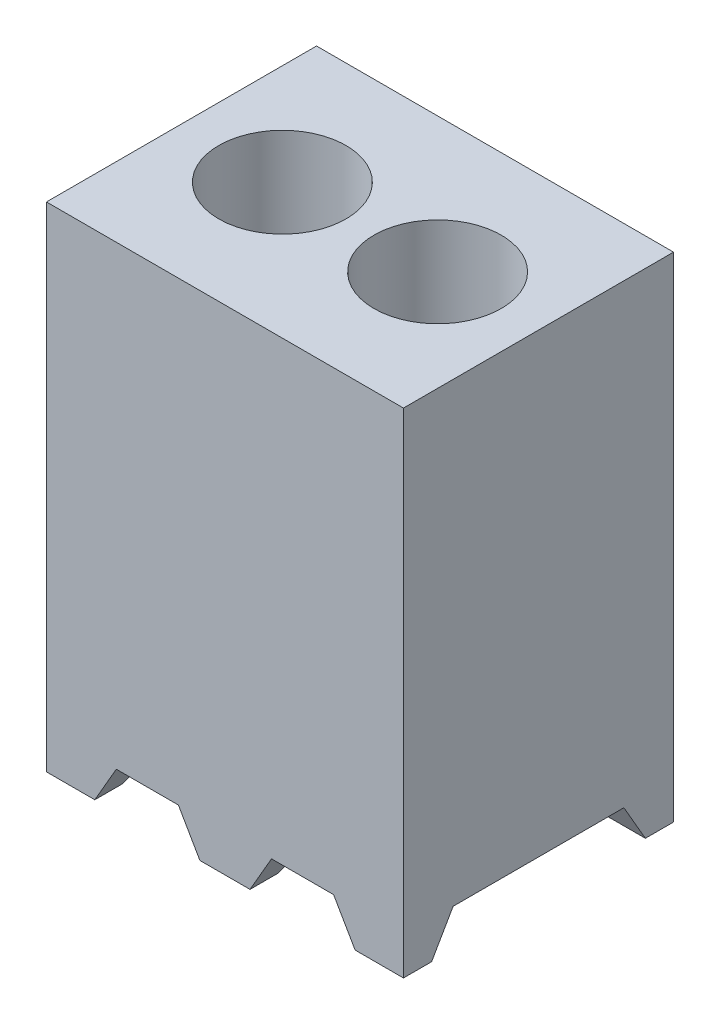
ISO-10303-21;
HEADER;
FILE_DESCRIPTION(('STEP AP214'),'2;1');
FILE_NAME('part.step','',(''),(''),'','','');
FILE_SCHEMA(('AUTOMOTIVE_DESIGN { 1 0 10303 214 1 1 1 1 }'));
ENDSEC;
DATA;
#1=APPLICATION_CONTEXT('core data for automotive mechanical design processes');
#2=APPLICATION_PROTOCOL_DEFINITION('international standard','automotive_design',2000,#1);
#3=PRODUCT_CONTEXT('',#1,'mechanical');
#4=PRODUCT('Part','Part','',(#3));
#5=PRODUCT_RELATED_PRODUCT_CATEGORY('part','',(#4));
#6=PRODUCT_DEFINITION_FORMATION('','',#4);
#7=PRODUCT_DEFINITION_CONTEXT('part definition',#1,'design');
#8=PRODUCT_DEFINITION('design','',#6,#7);
#9=PRODUCT_DEFINITION_SHAPE('','',#8);
#10=(LENGTH_UNIT() NAMED_UNIT(*) SI_UNIT(.MILLI.,.METRE.));
#11=(NAMED_UNIT(*) PLANE_ANGLE_UNIT() SI_UNIT($,.RADIAN.));
#12=(NAMED_UNIT(*) SI_UNIT($,.STERADIAN.) SOLID_ANGLE_UNIT());
#13=UNCERTAINTY_MEASURE_WITH_UNIT(LENGTH_MEASURE(1.E-05),#10,'distance_accuracy_value','');
#14=(GEOMETRIC_REPRESENTATION_CONTEXT(3) GLOBAL_UNCERTAINTY_ASSIGNED_CONTEXT((#13)) GLOBAL_UNIT_ASSIGNED_CONTEXT((#10,
#11,#12)) REPRESENTATION_CONTEXT('',''));
#15=CARTESIAN_POINT('',(0.,0.,0.));
#16=DIRECTION('',(0.,0.,1.));
#17=DIRECTION('',(1.,0.,0.));
#18=AXIS2_PLACEMENT_3D('',#15,#16,#17);
#19=CARTESIAN_POINT('',(0.,-4.0386,0.));
#20=DIRECTION('',(0.,1.,0.));
#21=DIRECTION('',(0.,0.,1.));
#22=AXIS2_PLACEMENT_3D('',#19,#20,#21);
#23=PLANE('',#22);
#24=DIRECTION('',(1.,0.,0.));
#25=VECTOR('',#24,1.);
#26=CARTESIAN_POINT('',(0.,-4.0386,0.));
#27=LINE('',#26,#25);
#28=CARTESIAN_POINT('',(2.525476362049,-4.0386,0.));
#29=VERTEX_POINT('',#28);
#30=CARTESIAN_POINT('',(2.92099999999999,-4.0386,0.));
#31=VERTEX_POINT('',#30);
#32=EDGE_CURVE('E311',#29,#31,#27,.T.);
#33=ORIENTED_EDGE('',*,*,#32,.F.);
#34=DIRECTION('',(0.,0.,1.));
#35=VECTOR('',#34,1.);
#36=CARTESIAN_POINT('',(2.525476362049,-4.0386,-2.2098));
#37=LINE('',#36,#35);
#38=CARTESIAN_POINT('',(2.525476362049,-4.0386,-0.230423637951));
#39=VERTEX_POINT('',#38);
#40=EDGE_CURVE('E215',#39,#29,#37,.T.);
#41=ORIENTED_EDGE('',*,*,#40,.F.);
#42=DIRECTION('',(1.,0.,0.));
#43=VECTOR('',#42,1.);
#44=CARTESIAN_POINT('',(0.,-4.0386,-0.230423637951));
#45=LINE('',#44,#43);
#46=CARTESIAN_POINT('',(2.92099999999999,-4.0386,-0.230423637951));
#47=VERTEX_POINT('',#46);
#48=EDGE_CURVE('E25',#39,#47,#45,.T.);
#49=ORIENTED_EDGE('',*,*,#48,.T.);
#50=DIRECTION('',(0.,0.,-1.));
#51=VECTOR('',#50,1.);
#52=CARTESIAN_POINT('',(2.92099999999999,-4.0386,0.));
#53=LINE('',#52,#51);
#54=EDGE_CURVE('E318',#31,#47,#53,.T.);
#55=ORIENTED_EDGE('',*,*,#54,.F.);
#56=EDGE_LOOP('',(#33,#41,#49,#55));
#57=FACE_BOUND('',#56,.T.);
#58=ADVANCED_FACE('F16',(#57),#23,.F.);
#59=DIRECTION('',(-1.,0.,0.));
#60=VECTOR('',#59,1.);
#61=CARTESIAN_POINT('',(0.,-4.0386,-1.97937636204899));
#62=LINE('',#61,#60);
#63=CARTESIAN_POINT('',(2.92099999999999,-4.0386,-1.97937636204899));
#64=VERTEX_POINT('',#63);
#65=CARTESIAN_POINT('',(2.525476362049,-4.0386,-1.97937636204899));
#66=VERTEX_POINT('',#65);
#67=EDGE_CURVE('E344',#64,#66,#62,.T.);
#68=ORIENTED_EDGE('',*,*,#67,.T.);
#69=CARTESIAN_POINT('',(2.525476362049,-4.0386,-2.2098));
#70=VERTEX_POINT('',#69);
#71=EDGE_CURVE('E213',#70,#66,#37,.T.);
#72=ORIENTED_EDGE('',*,*,#71,.F.);
#73=DIRECTION('',(-1.,0.,0.));
#74=VECTOR('',#73,1.);
#75=CARTESIAN_POINT('',(2.92099999999999,-4.0386,-2.20979999999999));
#76=LINE('',#75,#74);
#77=CARTESIAN_POINT('',(2.92099999999999,-4.0386,-2.20979999999999));
#78=VERTEX_POINT('',#77);
#79=EDGE_CURVE('E322',#78,#70,#76,.T.);
#80=ORIENTED_EDGE('',*,*,#79,.F.);
#81=EDGE_CURVE('E316',#64,#78,#53,.T.);
#82=ORIENTED_EDGE('',*,*,#81,.F.);
#83=EDGE_LOOP('',(#68,#72,#80,#82));
#84=FACE_BOUND('',#83,.T.);
#85=ADVANCED_FACE('F396',(#84),#23,.F.);
#86=CARTESIAN_POINT('',(-60.96,-3.7338,-0.4064));
#87=DIRECTION('',(0.,0.500000000000004,0.866025403784436));
#88=DIRECTION('',(0.,-0.866025403784436,0.500000000000004));
#89=AXIS2_PLACEMENT_3D('',#86,#87,#88);
#90=PLANE('',#89);
#91=ORIENTED_EDGE('',*,*,#48,.F.);
#92=DIRECTION('',(-0.447213595499954,0.774596669241483,-0.447213595499962));
#93=VECTOR('',#92,1.);
#94=CARTESIAN_POINT('',(-10.3123999999998,18.1972541203562,-13.0683));
#95=LINE('',#94,#93);
#96=CARTESIAN_POINT('',(2.3495,-3.7338,-0.4064));
#97=VERTEX_POINT('',#96);
#98=EDGE_CURVE('E224',#39,#97,#95,.T.);
#99=ORIENTED_EDGE('',*,*,#98,.T.);
#100=DIRECTION('',(1.,0.,0.));
#101=VECTOR('',#100,1.);
#102=CARTESIAN_POINT('',(-60.96,-3.7338,-0.4064));
#103=LINE('',#102,#101);
#104=CARTESIAN_POINT('',(2.92099999999999,-3.7338,-0.4064));
#105=VERTEX_POINT('',#104);
#106=EDGE_CURVE('E297',#97,#105,#103,.T.);
#107=ORIENTED_EDGE('',*,*,#106,.T.);
#108=DIRECTION('',(0.,-0.866025403784436,0.500000000000004));
#109=VECTOR('',#108,1.);
#110=CARTESIAN_POINT('',(2.92099999999999,-3.7338,-0.4064));
#111=LINE('',#110,#109);
#112=EDGE_CURVE('E282',#105,#47,#111,.T.);
#113=ORIENTED_EDGE('',*,*,#112,.T.);
#114=EDGE_LOOP('',(#91,#99,#107,#113));
#115=FACE_BOUND('',#114,.T.);
#116=ADVANCED_FACE('F402',(#115),#90,.F.);
#117=CARTESIAN_POINT('',(-60.96,-3.7338,-1.8034));
#118=DIRECTION('',(0.,0.499999999999982,-0.866025403784449));
#119=DIRECTION('',(0.,0.866025403784449,0.499999999999982));
#120=AXIS2_PLACEMENT_3D('',#117,#118,#119);
#121=PLANE('',#120);
#122=DIRECTION('',(1.,0.,0.));
#123=VECTOR('',#122,1.);
#124=CARTESIAN_POINT('',(-60.96,-3.7338,-1.8034));
#125=LINE('',#124,#123);
#126=CARTESIAN_POINT('',(2.3495,-3.7338,-1.8034));
#127=VERTEX_POINT('',#126);
#128=CARTESIAN_POINT('',(2.92099999999999,-3.7338,-1.8034));
#129=VERTEX_POINT('',#128);
#130=EDGE_CURVE('E291',#127,#129,#125,.T.);
#131=ORIENTED_EDGE('',*,*,#130,.F.);
#132=DIRECTION('',(0.44721359549996,-0.774596669241492,-0.447213595499941));
#133=VECTOR('',#132,1.);
#134=CARTESIAN_POINT('',(-10.3124000000001,18.1972541203567,10.8584999999996));
#135=LINE('',#134,#133);
#136=EDGE_CURVE('E221',#127,#66,#135,.T.);
#137=ORIENTED_EDGE('',*,*,#136,.T.);
#138=ORIENTED_EDGE('',*,*,#67,.F.);
#139=DIRECTION('',(0.,0.866025403784449,0.499999999999982));
#140=VECTOR('',#139,1.);
#141=CARTESIAN_POINT('',(2.92099999999999,-3.7338,-1.8034));
#142=LINE('',#141,#140);
#143=EDGE_CURVE('E285',#64,#129,#142,.T.);
#144=ORIENTED_EDGE('',*,*,#143,.T.);
#145=EDGE_LOOP('',(#131,#137,#138,#144));
#146=FACE_BOUND('',#145,.T.);
#147=ADVANCED_FACE('F427',(#146),#121,.F.);
#148=CARTESIAN_POINT('',(1.255476362049,-4.0386,-0.230423637951));
#149=VERTEX_POINT('',#148);
#150=CARTESIAN_POINT('',(1.665523637951,-4.0386,-0.230423637950998));
#151=VERTEX_POINT('',#150);
#152=EDGE_CURVE('E24',#149,#151,#45,.T.);
#153=ORIENTED_EDGE('',*,*,#152,.T.);
#154=DIRECTION('',(0.,0.,1.));
#155=VECTOR('',#154,1.);
#156=CARTESIAN_POINT('',(1.665523637951,-4.0386,-2.2098));
#157=LINE('',#156,#155);
#158=CARTESIAN_POINT('',(1.665523637951,-4.0386,0.));
#159=VERTEX_POINT('',#158);
#160=EDGE_CURVE('E189',#151,#159,#157,.T.);
#161=ORIENTED_EDGE('',*,*,#160,.T.);
#162=CARTESIAN_POINT('',(1.255476362049,-4.0386,0.));
#163=VERTEX_POINT('',#162);
#164=EDGE_CURVE('E317',#163,#159,#27,.T.);
#165=ORIENTED_EDGE('',*,*,#164,.F.);
#166=DIRECTION('',(0.,0.,1.));
#167=VECTOR('',#166,1.);
#168=CARTESIAN_POINT('',(1.255476362049,-4.0386,-2.2098));
#169=LINE('',#168,#167);
#170=EDGE_CURVE('E252',#149,#163,#169,.T.);
#171=ORIENTED_EDGE('',*,*,#170,.F.);
#172=EDGE_LOOP('',(#153,#161,#165,#171));
#173=FACE_BOUND('',#172,.T.);
#174=ADVANCED_FACE('F403',(#173),#23,.F.);
#175=CARTESIAN_POINT('',(1.665523637951,-4.0386,-2.2098));
#176=VERTEX_POINT('',#175);
#177=CARTESIAN_POINT('',(1.255476362049,-4.0386,-2.2098));
#178=VERTEX_POINT('',#177);
#179=EDGE_CURVE('E325',#176,#178,#76,.T.);
#180=ORIENTED_EDGE('',*,*,#179,.F.);
#181=CARTESIAN_POINT('',(1.665523637951,-4.0386,-1.97937636204899));
#182=VERTEX_POINT('',#181);
#183=EDGE_CURVE('E32',#176,#182,#157,.T.);
#184=ORIENTED_EDGE('',*,*,#183,.T.);
#185=CARTESIAN_POINT('',(1.255476362049,-4.0386,-1.97937636204899));
#186=VERTEX_POINT('',#185);
#187=EDGE_CURVE('E346',#182,#186,#62,.T.);
#188=ORIENTED_EDGE('',*,*,#187,.T.);
#189=EDGE_CURVE('E249',#178,#186,#169,.T.);
#190=ORIENTED_EDGE('',*,*,#189,.F.);
#191=EDGE_LOOP('',(#180,#184,#188,#190));
#192=FACE_BOUND('',#191,.T.);
#193=ADVANCED_FACE('F373',(#192),#23,.F.);
#194=CARTESIAN_POINT('',(1.0795,-3.7338,-0.4064));
#195=VERTEX_POINT('',#194);
#196=CARTESIAN_POINT('',(1.8415,-3.7338,-0.4064));
#197=VERTEX_POINT('',#196);
#198=EDGE_CURVE('E296',#195,#197,#103,.T.);
#199=ORIENTED_EDGE('',*,*,#198,.T.);
#200=DIRECTION('',(-0.447213595499953,-0.774596669241483,0.447213595499963));
#201=VECTOR('',#200,1.);
#202=CARTESIAN_POINT('',(-10.7187999999998,-25.4888777583071,12.1539));
#203=LINE('',#202,#201);
#204=EDGE_CURVE('E218',#197,#151,#203,.T.);
#205=ORIENTED_EDGE('',*,*,#204,.T.);
#206=ORIENTED_EDGE('',*,*,#152,.F.);
#207=DIRECTION('',(-0.447213595499954,0.774596669241483,-0.447213595499962));
#208=VECTOR('',#207,1.);
#209=CARTESIAN_POINT('',(-11.3283999999998,17.7573132152337,-12.8143));
#210=LINE('',#209,#208);
#211=EDGE_CURVE('E267',#149,#195,#210,.T.);
#212=ORIENTED_EDGE('',*,*,#211,.T.);
#213=EDGE_LOOP('',(#199,#205,#206,#212));
#214=FACE_BOUND('',#213,.T.);
#215=ADVANCED_FACE('F425',(#214),#90,.F.);
#216=ORIENTED_EDGE('',*,*,#187,.F.);
#217=DIRECTION('',(0.447213595499959,0.774596669241493,0.447213595499941));
#218=VECTOR('',#217,1.);
#219=CARTESIAN_POINT('',(-10.7188,-25.4888777583077,-14.3636999999996));
#220=LINE('',#219,#218);
#221=CARTESIAN_POINT('',(1.8415,-3.7338,-1.8034));
#222=VERTEX_POINT('',#221);
#223=EDGE_CURVE('E211',#182,#222,#220,.T.);
#224=ORIENTED_EDGE('',*,*,#223,.T.);
#225=CARTESIAN_POINT('',(1.0795,-3.7338,-1.8034));
#226=VERTEX_POINT('',#225);
#227=EDGE_CURVE('E187',#226,#222,#125,.T.);
#228=ORIENTED_EDGE('',*,*,#227,.F.);
#229=DIRECTION('',(0.44721359549996,-0.774596669241492,-0.447213595499941));
#230=VECTOR('',#229,1.);
#231=CARTESIAN_POINT('',(-11.3284000000001,17.7573132152342,10.6044999999996));
#232=LINE('',#231,#230);
#233=EDGE_CURVE('E264',#226,#186,#232,.T.);
#234=ORIENTED_EDGE('',*,*,#233,.T.);
#235=EDGE_LOOP('',(#216,#224,#228,#234));
#236=FACE_BOUND('',#235,.T.);
#237=ADVANCED_FACE('F376',(#236),#121,.F.);
#238=CARTESIAN_POINT('',(0.,-4.0386,-0.230423637951));
#239=VERTEX_POINT('',#238);
#240=CARTESIAN_POINT('',(0.395523637950998,-4.03860000000001,-0.230423637950998));
#241=VERTEX_POINT('',#240);
#242=EDGE_CURVE('E11',#239,#241,#45,.T.);
#243=ORIENTED_EDGE('',*,*,#242,.T.);
#244=DIRECTION('',(0.,0.,1.));
#245=VECTOR('',#244,1.);
#246=CARTESIAN_POINT('',(0.395523637951004,-4.0386,-2.2098));
#247=LINE('',#246,#245);
#248=CARTESIAN_POINT('',(0.395523637951004,-4.0386,0.));
#249=VERTEX_POINT('',#248);
#250=EDGE_CURVE('E256',#241,#249,#247,.T.);
#251=ORIENTED_EDGE('',*,*,#250,.T.);
#252=CARTESIAN_POINT('',(0.,-4.0386,0.));
#253=VERTEX_POINT('',#252);
#254=EDGE_CURVE('E313',#253,#249,#27,.T.);
#255=ORIENTED_EDGE('',*,*,#254,.F.);
#256=DIRECTION('',(0.,0.,1.));
#257=VECTOR('',#256,1.);
#258=CARTESIAN_POINT('',(0.,-4.0386,-2.2098));
#259=LINE('',#258,#257);
#260=EDGE_CURVE('E312',#239,#253,#259,.T.);
#261=ORIENTED_EDGE('',*,*,#260,.F.);
#262=EDGE_LOOP('',(#243,#251,#255,#261));
#263=FACE_BOUND('',#262,.T.);
#264=ADVANCED_FACE('F410',(#263),#23,.F.);
#265=CARTESIAN_POINT('',(0.,-4.0386,-2.2098));
#266=DIRECTION('',(-1.,0.,0.));
#267=DIRECTION('',(0.,0.,1.));
#268=AXIS2_PLACEMENT_3D('',#265,#266,#267);
#269=PLANE('',#268);
#270=DIRECTION('',(0.,0.866025403784436,-0.500000000000004));
#271=VECTOR('',#270,1.);
#272=CARTESIAN_POINT('',(0.,-3.18150489340757,-0.725267728463258));
#273=LINE('',#272,#271);
#274=CARTESIAN_POINT('',(0.,-3.7338,-0.4064));
#275=VERTEX_POINT('',#274);
#276=EDGE_CURVE('E303',#239,#275,#273,.T.);
#277=ORIENTED_EDGE('',*,*,#276,.F.);
#278=ORIENTED_EDGE('',*,*,#260,.T.);
#279=DIRECTION('',(0.,1.,0.));
#280=VECTOR('',#279,1.);
#281=CARTESIAN_POINT('',(0.,-4.0386,0.));
#282=LINE('',#281,#280);
#283=CARTESIAN_POINT('',(0.,0.,0.));
#284=VERTEX_POINT('',#283);
#285=EDGE_CURVE('E324',#253,#284,#282,.T.);
#286=ORIENTED_EDGE('',*,*,#285,.T.);
#287=DIRECTION('',(0.,0.,1.));
#288=VECTOR('',#287,1.);
#289=CARTESIAN_POINT('',(0.,0.,-2.2098));
#290=LINE('',#289,#288);
#291=CARTESIAN_POINT('',(0.,0.,-2.2098));
#292=VERTEX_POINT('',#291);
#293=EDGE_CURVE('E307',#292,#284,#290,.T.);
#294=ORIENTED_EDGE('',*,*,#293,.F.);
#295=DIRECTION('',(0.,1.,0.));
#296=VECTOR('',#295,1.);
#297=CARTESIAN_POINT('',(0.,-4.0386,-2.2098));
#298=LINE('',#297,#296);
#299=CARTESIAN_POINT('',(0.,-4.0386,-2.2098));
#300=VERTEX_POINT('',#299);
#301=EDGE_CURVE('E337',#300,#292,#298,.T.);
#302=ORIENTED_EDGE('',*,*,#301,.F.);
#303=CARTESIAN_POINT('',(0.,-4.0386,-1.97937636204899));
#304=VERTEX_POINT('',#303);
#305=EDGE_CURVE('E308',#300,#304,#259,.T.);
#306=ORIENTED_EDGE('',*,*,#305,.T.);
#307=DIRECTION('',(0.,-0.866025403784449,-0.499999999999982));
#308=VECTOR('',#307,1.);
#309=CARTESIAN_POINT('',(0.,-4.138376362049,-2.03698227153674));
#310=LINE('',#309,#308);
#311=CARTESIAN_POINT('',(0.,-3.7338,-1.8034));
#312=VERTEX_POINT('',#311);
#313=EDGE_CURVE('E295',#312,#304,#310,.T.);
#314=ORIENTED_EDGE('',*,*,#313,.F.);
#315=DIRECTION('',(0.,0.,-1.));
#316=VECTOR('',#315,1.);
#317=CARTESIAN_POINT('',(0.,-3.7338,-2.2098));
#318=LINE('',#317,#316);
#319=EDGE_CURVE('E305',#275,#312,#318,.T.);
#320=ORIENTED_EDGE('',*,*,#319,.F.);
#321=EDGE_LOOP('',(#277,#278,#286,#294,#302,#306,#314,#320));
#322=FACE_BOUND('',#321,.T.);
#323=ADVANCED_FACE('F18',(#322),#269,.T.);
#324=CARTESIAN_POINT('',(2.92099999999999,-4.0386,-2.20979999999999));
#325=DIRECTION('',(0.,0.,-1.));
#326=DIRECTION('',(-1.,0.,0.));
#327=AXIS2_PLACEMENT_3D('',#324,#325,#326);
#328=PLANE('',#327);
#329=DIRECTION('',(-0.499999999999997,0.86602540378444,0.));
#330=VECTOR('',#329,1.);
#331=CARTESIAN_POINT('',(2.525476362049,-4.0386,-2.2098));
#332=LINE('',#331,#330);
#333=CARTESIAN_POINT('',(2.3495,-3.7338,-2.2098));
#334=VERTEX_POINT('',#333);
#335=EDGE_CURVE('E196',#70,#334,#332,.T.);
#336=ORIENTED_EDGE('',*,*,#335,.T.);
#337=DIRECTION('',(-1.,0.,0.));
#338=VECTOR('',#337,1.);
#339=CARTESIAN_POINT('',(1.8415,-3.7338,-2.2098));
#340=LINE('',#339,#338);
#341=CARTESIAN_POINT('',(1.8415,-3.7338,-2.2098));
#342=VERTEX_POINT('',#341);
#343=EDGE_CURVE('E183',#334,#342,#340,.T.);
#344=ORIENTED_EDGE('',*,*,#343,.T.);
#345=DIRECTION('',(-0.499999999999996,-0.866025403784441,0.));
#346=VECTOR('',#345,1.);
#347=CARTESIAN_POINT('',(1.665523637951,-4.0386,-2.2098));
#348=LINE('',#347,#346);
#349=EDGE_CURVE('E192',#342,#176,#348,.T.);
#350=ORIENTED_EDGE('',*,*,#349,.T.);
#351=ORIENTED_EDGE('',*,*,#179,.T.);
#352=DIRECTION('',(-0.499999999999997,0.86602540378444,0.));
#353=VECTOR('',#352,1.);
#354=CARTESIAN_POINT('',(1.255476362049,-4.0386,-2.2098));
#355=LINE('',#354,#353);
#356=CARTESIAN_POINT('',(1.0795,-3.7338,-2.2098));
#357=VERTEX_POINT('',#356);
#358=EDGE_CURVE('E235',#178,#357,#355,.T.);
#359=ORIENTED_EDGE('',*,*,#358,.T.);
#360=DIRECTION('',(-1.,0.,0.));
#361=VECTOR('',#360,1.);
#362=CARTESIAN_POINT('',(0.5715,-3.7338,-2.2098));
#363=LINE('',#362,#361);
#364=CARTESIAN_POINT('',(0.5715,-3.7338,-2.2098));
#365=VERTEX_POINT('',#364);
#366=EDGE_CURVE('E228',#357,#365,#363,.T.);
#367=ORIENTED_EDGE('',*,*,#366,.T.);
#368=DIRECTION('',(-0.499999999999996,-0.866025403784441,0.));
#369=VECTOR('',#368,1.);
#370=CARTESIAN_POINT('',(0.395523637951004,-4.0386,-2.2098));
#371=LINE('',#370,#369);
#372=CARTESIAN_POINT('',(0.395523637951004,-4.0386,-2.2098));
#373=VERTEX_POINT('',#372);
#374=EDGE_CURVE('E231',#365,#373,#371,.T.);
#375=ORIENTED_EDGE('',*,*,#374,.T.);
#376=EDGE_CURVE('E321',#373,#300,#76,.T.);
#377=ORIENTED_EDGE('',*,*,#376,.T.);
#378=ORIENTED_EDGE('',*,*,#301,.T.);
#379=DIRECTION('',(-1.,0.,0.));
#380=VECTOR('',#379,1.);
#381=CARTESIAN_POINT('',(2.92099999999999,0.,-2.20979999999999));
#382=LINE('',#381,#380);
#383=CARTESIAN_POINT('',(2.92099999999999,0.,-2.20979999999999));
#384=VERTEX_POINT('',#383);
#385=EDGE_CURVE('E334',#384,#292,#382,.T.);
#386=ORIENTED_EDGE('',*,*,#385,.F.);
#387=DIRECTION('',(0.,1.,0.));
#388=VECTOR('',#387,1.);
#389=CARTESIAN_POINT('',(2.92099999999999,-4.0386,-2.20979999999999));
#390=LINE('',#389,#388);
#391=EDGE_CURVE('E340',#78,#384,#390,.T.);
#392=ORIENTED_EDGE('',*,*,#391,.F.);
#393=ORIENTED_EDGE('',*,*,#79,.T.);
#394=EDGE_LOOP('',(#336,#344,#350,#351,#359,#367,#375,#377,#378,#386,#392,#393));
#395=FACE_BOUND('',#394,.T.);
#396=ADVANCED_FACE('F198',(#395),#328,.T.);
#397=CARTESIAN_POINT('',(2.92099999999999,-4.0386,0.));
#398=DIRECTION('',(1.,0.,0.));
#399=DIRECTION('',(0.,0.,-1.));
#400=AXIS2_PLACEMENT_3D('',#397,#398,#399);
#401=PLANE('',#400);
#402=ORIENTED_EDGE('',*,*,#112,.F.);
#403=DIRECTION('',(0.,0.,1.));
#404=VECTOR('',#403,1.);
#405=CARTESIAN_POINT('',(2.92099999999999,-3.7338,-0.4064));
#406=LINE('',#405,#404);
#407=EDGE_CURVE('E288',#129,#105,#406,.T.);
#408=ORIENTED_EDGE('',*,*,#407,.F.);
#409=ORIENTED_EDGE('',*,*,#143,.F.);
#410=ORIENTED_EDGE('',*,*,#81,.T.);
#411=ORIENTED_EDGE('',*,*,#391,.T.);
#412=DIRECTION('',(0.,0.,-1.));
#413=VECTOR('',#412,1.);
#414=CARTESIAN_POINT('',(2.92099999999999,0.,0.));
#415=LINE('',#414,#413);
#416=CARTESIAN_POINT('',(2.92099999999999,0.,0.));
#417=VERTEX_POINT('',#416);
#418=EDGE_CURVE('E331',#417,#384,#415,.T.);
#419=ORIENTED_EDGE('',*,*,#418,.F.);
#420=DIRECTION('',(0.,1.,0.));
#421=VECTOR('',#420,1.);
#422=CARTESIAN_POINT('',(2.92099999999999,-4.0386,0.));
#423=LINE('',#422,#421);
#424=EDGE_CURVE('E342',#31,#417,#423,.T.);
#425=ORIENTED_EDGE('',*,*,#424,.F.);
#426=ORIENTED_EDGE('',*,*,#54,.T.);
#427=EDGE_LOOP('',(#402,#408,#409,#410,#411,#419,#425,#426));
#428=FACE_BOUND('',#427,.T.);
#429=ADVANCED_FACE('F417',(#428),#401,.T.);
#430=CARTESIAN_POINT('',(0.,-4.0386,0.));
#431=DIRECTION('',(0.,0.,1.));
#432=DIRECTION('',(1.,0.,0.));
#433=AXIS2_PLACEMENT_3D('',#430,#431,#432);
#434=PLANE('',#433);
#435=DIRECTION('',(-0.499999999999997,0.86602540378444,0.));
#436=VECTOR('',#435,1.);
#437=CARTESIAN_POINT('',(2.525476362049,-4.0386,0.));
#438=LINE('',#437,#436);
#439=CARTESIAN_POINT('',(2.3495,-3.7338,0.));
#440=VERTEX_POINT('',#439);
#441=EDGE_CURVE('E200',#29,#440,#438,.T.);
#442=ORIENTED_EDGE('',*,*,#441,.F.);
#443=ORIENTED_EDGE('',*,*,#32,.T.);
#444=ORIENTED_EDGE('',*,*,#424,.T.);
#445=DIRECTION('',(1.,0.,0.));
#446=VECTOR('',#445,1.);
#447=CARTESIAN_POINT('',(0.,0.,0.));
#448=LINE('',#447,#446);
#449=EDGE_CURVE('E328',#284,#417,#448,.T.);
#450=ORIENTED_EDGE('',*,*,#449,.F.);
#451=ORIENTED_EDGE('',*,*,#285,.F.);
#452=ORIENTED_EDGE('',*,*,#254,.T.);
#453=DIRECTION('',(-0.499999999999996,-0.866025403784441,0.));
#454=VECTOR('',#453,1.);
#455=CARTESIAN_POINT('',(0.395523637951004,-4.0386,0.));
#456=LINE('',#455,#454);
#457=CARTESIAN_POINT('',(0.5715,-3.7338,0.));
#458=VERTEX_POINT('',#457);
#459=EDGE_CURVE('E241',#458,#249,#456,.T.);
#460=ORIENTED_EDGE('',*,*,#459,.F.);
#461=DIRECTION('',(-1.,0.,0.));
#462=VECTOR('',#461,1.);
#463=CARTESIAN_POINT('',(0.5715,-3.7338,0.));
#464=LINE('',#463,#462);
#465=CARTESIAN_POINT('',(1.0795,-3.7338,0.));
#466=VERTEX_POINT('',#465);
#467=EDGE_CURVE('E227',#466,#458,#464,.T.);
#468=ORIENTED_EDGE('',*,*,#467,.F.);
#469=DIRECTION('',(-0.499999999999997,0.86602540378444,0.));
#470=VECTOR('',#469,1.);
#471=CARTESIAN_POINT('',(1.255476362049,-4.0386,0.));
#472=LINE('',#471,#470);
#473=EDGE_CURVE('E232',#163,#466,#472,.T.);
#474=ORIENTED_EDGE('',*,*,#473,.F.);
#475=ORIENTED_EDGE('',*,*,#164,.T.);
#476=DIRECTION('',(-0.499999999999996,-0.866025403784441,0.));
#477=VECTOR('',#476,1.);
#478=CARTESIAN_POINT('',(1.665523637951,-4.0386,0.));
#479=LINE('',#478,#477);
#480=CARTESIAN_POINT('',(1.8415,-3.7338,0.));
#481=VERTEX_POINT('',#480);
#482=EDGE_CURVE('E203',#481,#159,#479,.T.);
#483=ORIENTED_EDGE('',*,*,#482,.F.);
#484=DIRECTION('',(-1.,0.,0.));
#485=VECTOR('',#484,1.);
#486=CARTESIAN_POINT('',(1.8415,-3.7338,0.));
#487=LINE('',#486,#485);
#488=EDGE_CURVE('E40',#440,#481,#487,.T.);
#489=ORIENTED_EDGE('',*,*,#488,.F.);
#490=EDGE_LOOP('',(#442,#443,#444,#450,#451,#452,#460,#468,#474,#475,#483,#489));
#491=FACE_BOUND('',#490,.T.);
#492=ADVANCED_FACE('F409',(#491),#434,.T.);
#493=ORIENTED_EDGE('',*,*,#376,.F.);
#494=CARTESIAN_POINT('',(0.395523637951003,-4.0386,-1.97937636204899));
#495=VERTEX_POINT('',#494);
#496=EDGE_CURVE('E253',#373,#495,#247,.T.);
#497=ORIENTED_EDGE('',*,*,#496,.T.);
#498=EDGE_CURVE('E339',#495,#304,#62,.T.);
#499=ORIENTED_EDGE('',*,*,#498,.T.);
#500=ORIENTED_EDGE('',*,*,#305,.F.);
#501=EDGE_LOOP('',(#493,#497,#499,#500));
#502=FACE_BOUND('',#501,.T.);
#503=ADVANCED_FACE('F354',(#502),#23,.F.);
#504=CARTESIAN_POINT('',(0.,0.,0.));
#505=DIRECTION('',(0.,1.,0.));
#506=DIRECTION('',(0.,0.,1.));
#507=AXIS2_PLACEMENT_3D('',#504,#505,#506);
#508=PLANE('',#507);
#509=CARTESIAN_POINT('',(2.0955,0.,-1.1049));
#510=DIRECTION('',(0.,1.,0.));
#511=DIRECTION('',(0.,0.,1.));
#512=AXIS2_PLACEMENT_3D('',#509,#510,#511);
#513=CIRCLE('',#512,0.520700000000014);
#514=CARTESIAN_POINT('',(2.0955,0.,-0.584199999999983));
#515=VERTEX_POINT('',#514);
#516=EDGE_CURVE('E270',#515,#515,#513,.T.);
#517=ORIENTED_EDGE('',*,*,#516,.F.);
#518=EDGE_LOOP('',(#517));
#519=FACE_BOUND('',#518,.T.);
#520=CARTESIAN_POINT('',(0.825499999999998,0.,-1.1049));
#521=DIRECTION('',(0.,1.,0.));
#522=DIRECTION('',(0.,0.,1.));
#523=AXIS2_PLACEMENT_3D('',#520,#521,#522);
#524=CIRCLE('',#523,0.520700000000014);
#525=CARTESIAN_POINT('',(0.825499999999998,0.,-0.584199999999986));
#526=VERTEX_POINT('',#525);
#527=EDGE_CURVE('E276',#526,#526,#524,.T.);
#528=ORIENTED_EDGE('',*,*,#527,.F.);
#529=EDGE_LOOP('',(#528));
#530=FACE_BOUND('',#529,.T.);
#531=ORIENTED_EDGE('',*,*,#293,.T.);
#532=ORIENTED_EDGE('',*,*,#449,.T.);
#533=ORIENTED_EDGE('',*,*,#418,.T.);
#534=ORIENTED_EDGE('',*,*,#385,.T.);
#535=EDGE_LOOP('',(#531,#532,#533,#534));
#536=FACE_BOUND('',#535,.T.);
#537=ADVANCED_FACE('F408',(#519,#530,#536),#508,.T.);
#538=CARTESIAN_POINT('',(0.5715,-3.7338,-0.4064));
#539=VERTEX_POINT('',#538);
#540=EDGE_CURVE('E292',#275,#539,#103,.T.);
#541=ORIENTED_EDGE('',*,*,#540,.T.);
#542=DIRECTION('',(-0.447213595499953,-0.774596669241483,0.447213595499963));
#543=VECTOR('',#542,1.);
#544=CARTESIAN_POINT('',(-11.7347999999997,-25.0489368531847,11.8999));
#545=LINE('',#544,#543);
#546=EDGE_CURVE('E261',#539,#241,#545,.T.);
#547=ORIENTED_EDGE('',*,*,#546,.T.);
#548=ORIENTED_EDGE('',*,*,#242,.F.);
#549=ORIENTED_EDGE('',*,*,#276,.T.);
#550=EDGE_LOOP('',(#541,#547,#548,#549));
#551=FACE_BOUND('',#550,.T.);
#552=ADVANCED_FACE('F415',(#551),#90,.F.);
#553=CARTESIAN_POINT('',(-60.96,-3.7338,-0.4064));
#554=DIRECTION('',(0.,1.,0.));
#555=DIRECTION('',(0.,0.,1.));
#556=AXIS2_PLACEMENT_3D('',#553,#554,#555);
#557=PLANE('',#556);
#558=CARTESIAN_POINT('',(2.0955,-3.7338,-1.1049));
#559=DIRECTION('',(0.,1.,0.));
#560=DIRECTION('',(0.,0.,1.));
#561=AXIS2_PLACEMENT_3D('',#558,#559,#560);
#562=CIRCLE('',#561,0.520700000000013);
#563=CARTESIAN_POINT('',(2.0955,-3.7338,-0.584199999999983));
#564=VERTEX_POINT('',#563);
#565=EDGE_CURVE('E273',#564,#564,#562,.T.);
#566=ORIENTED_EDGE('',*,*,#565,.T.);
#567=EDGE_LOOP('',(#566));
#568=FACE_BOUND('',#567,.T.);
#569=CARTESIAN_POINT('',(0.825499999999998,-3.7338,-1.1049));
#570=DIRECTION('',(0.,1.,0.));
#571=DIRECTION('',(0.,0.,1.));
#572=AXIS2_PLACEMENT_3D('',#569,#570,#571);
#573=CIRCLE('',#572,0.520700000000013);
#574=CARTESIAN_POINT('',(0.825499999999998,-3.7338,-0.584199999999986));
#575=VERTEX_POINT('',#574);
#576=EDGE_CURVE('E279',#575,#575,#573,.T.);
#577=ORIENTED_EDGE('',*,*,#576,.T.);
#578=EDGE_LOOP('',(#577));
#579=FACE_BOUND('',#578,.T.);
#580=ORIENTED_EDGE('',*,*,#227,.T.);
#581=DIRECTION('',(0.,0.,1.));
#582=VECTOR('',#581,1.);
#583=CARTESIAN_POINT('',(1.8415,-3.7338,-2.2098));
#584=LINE('',#583,#582);
#585=EDGE_CURVE('E179',#342,#222,#584,.T.);
#586=ORIENTED_EDGE('',*,*,#585,.F.);
#587=ORIENTED_EDGE('',*,*,#343,.F.);
#588=DIRECTION('',(0.,0.,1.));
#589=VECTOR('',#588,1.);
#590=CARTESIAN_POINT('',(2.3495,-3.7338,-2.2098));
#591=LINE('',#590,#589);
#592=EDGE_CURVE('E209',#334,#127,#591,.T.);
#593=ORIENTED_EDGE('',*,*,#592,.T.);
#594=ORIENTED_EDGE('',*,*,#130,.T.);
#595=ORIENTED_EDGE('',*,*,#407,.T.);
#596=ORIENTED_EDGE('',*,*,#106,.F.);
#597=EDGE_CURVE('E212',#97,#440,#591,.T.);
#598=ORIENTED_EDGE('',*,*,#597,.T.);
#599=ORIENTED_EDGE('',*,*,#488,.T.);
#600=EDGE_CURVE('E190',#197,#481,#584,.T.);
#601=ORIENTED_EDGE('',*,*,#600,.F.);
#602=ORIENTED_EDGE('',*,*,#198,.F.);
#603=DIRECTION('',(0.,0.,1.));
#604=VECTOR('',#603,1.);
#605=CARTESIAN_POINT('',(1.0795,-3.7338,-2.2098));
#606=LINE('',#605,#604);
#607=EDGE_CURVE('E248',#195,#466,#606,.T.);
#608=ORIENTED_EDGE('',*,*,#607,.T.);
#609=ORIENTED_EDGE('',*,*,#467,.T.);
#610=DIRECTION('',(0.,0.,1.));
#611=VECTOR('',#610,1.);
#612=CARTESIAN_POINT('',(0.5715,-3.7338,-2.2098));
#613=LINE('',#612,#611);
#614=EDGE_CURVE('E238',#539,#458,#613,.T.);
#615=ORIENTED_EDGE('',*,*,#614,.F.);
#616=ORIENTED_EDGE('',*,*,#540,.F.);
#617=ORIENTED_EDGE('',*,*,#319,.T.);
#618=CARTESIAN_POINT('',(0.571500000000005,-3.7338,-1.8034));
#619=VERTEX_POINT('',#618);
#620=EDGE_CURVE('E298',#312,#619,#125,.T.);
#621=ORIENTED_EDGE('',*,*,#620,.T.);
#622=EDGE_CURVE('E257',#365,#619,#613,.T.);
#623=ORIENTED_EDGE('',*,*,#622,.F.);
#624=ORIENTED_EDGE('',*,*,#366,.F.);
#625=EDGE_CURVE('E245',#357,#226,#606,.T.);
#626=ORIENTED_EDGE('',*,*,#625,.T.);
#627=EDGE_LOOP('',(#580,#586,#587,#593,#594,#595,#596,#598,#599,#601,#602,#608,#609,#615,#616,
#617,#621,#623,#624,#626));
#628=FACE_BOUND('',#627,.T.);
#629=ADVANCED_FACE('F180',(#568,#579,#628),#557,.F.);
#630=ORIENTED_EDGE('',*,*,#498,.F.);
#631=DIRECTION('',(0.447213595499959,0.774596669241493,0.447213595499941));
#632=VECTOR('',#631,1.);
#633=CARTESIAN_POINT('',(-11.7348,-25.0489368531852,-14.1096999999996));
#634=LINE('',#633,#632);
#635=EDGE_CURVE('E247',#495,#619,#634,.T.);
#636=ORIENTED_EDGE('',*,*,#635,.T.);
#637=ORIENTED_EDGE('',*,*,#620,.F.);
#638=ORIENTED_EDGE('',*,*,#313,.T.);
#639=EDGE_LOOP('',(#630,#636,#637,#638));
#640=FACE_BOUND('',#639,.T.);
#641=ADVANCED_FACE('F358',(#640),#121,.F.);
#642=CARTESIAN_POINT('',(0.825499999999998,0.,-1.1049));
#643=DIRECTION('',(0.,1.,0.));
#644=DIRECTION('',(0.,0.,1.));
#645=AXIS2_PLACEMENT_3D('',#642,#643,#644);
#646=CYLINDRICAL_SURFACE('',#645,0.520700000000013);
#647=ORIENTED_EDGE('',*,*,#527,.T.);
#648=EDGE_LOOP('',(#647));
#649=FACE_BOUND('',#648,.T.);
#650=ORIENTED_EDGE('',*,*,#576,.F.);
#651=EDGE_LOOP('',(#650));
#652=FACE_BOUND('',#651,.T.);
#653=ADVANCED_FACE('F602',(#649,#652),#646,.F.);
#654=CARTESIAN_POINT('',(2.0955,0.,-1.1049));
#655=DIRECTION('',(0.,1.,0.));
#656=DIRECTION('',(0.,0.,1.));
#657=AXIS2_PLACEMENT_3D('',#654,#655,#656);
#658=CYLINDRICAL_SURFACE('',#657,0.520700000000013);
#659=ORIENTED_EDGE('',*,*,#516,.T.);
#660=EDGE_LOOP('',(#659));
#661=FACE_BOUND('',#660,.T.);
#662=ORIENTED_EDGE('',*,*,#565,.F.);
#663=EDGE_LOOP('',(#662));
#664=FACE_BOUND('',#663,.T.);
#665=ADVANCED_FACE('F390',(#661,#664),#658,.F.);
#666=CARTESIAN_POINT('',(1.255476362049,-4.0386,-2.2098));
#667=DIRECTION('',(0.86602540378444,0.499999999999997,0.));
#668=DIRECTION('',(-0.499999999999997,0.86602540378444,0.));
#669=AXIS2_PLACEMENT_3D('',#666,#667,#668);
#670=PLANE('',#669);
#671=ORIENTED_EDGE('',*,*,#625,.F.);
#672=ORIENTED_EDGE('',*,*,#358,.F.);
#673=ORIENTED_EDGE('',*,*,#189,.T.);
#674=ORIENTED_EDGE('',*,*,#233,.F.);
#675=EDGE_LOOP('',(#671,#672,#673,#674));
#676=FACE_BOUND('',#675,.T.);
#677=ADVANCED_FACE('F371',(#676),#670,.F.);
#678=CARTESIAN_POINT('',(0.395523637951004,-4.0386,-2.2098));
#679=DIRECTION('',(-0.866025403784441,0.499999999999996,0.));
#680=DIRECTION('',(-0.499999999999996,-0.866025403784441,0.));
#681=AXIS2_PLACEMENT_3D('',#678,#679,#680);
#682=PLANE('',#681);
#683=ORIENTED_EDGE('',*,*,#496,.F.);
#684=ORIENTED_EDGE('',*,*,#374,.F.);
#685=ORIENTED_EDGE('',*,*,#622,.T.);
#686=ORIENTED_EDGE('',*,*,#635,.F.);
#687=EDGE_LOOP('',(#683,#684,#685,#686));
#688=FACE_BOUND('',#687,.T.);
#689=ADVANCED_FACE('F378',(#688),#682,.F.);
#690=ORIENTED_EDGE('',*,*,#170,.T.);
#691=ORIENTED_EDGE('',*,*,#473,.T.);
#692=ORIENTED_EDGE('',*,*,#607,.F.);
#693=ORIENTED_EDGE('',*,*,#211,.F.);
#694=EDGE_LOOP('',(#690,#691,#692,#693));
#695=FACE_BOUND('',#694,.T.);
#696=ADVANCED_FACE('F380',(#695),#670,.F.);
#697=ORIENTED_EDGE('',*,*,#614,.T.);
#698=ORIENTED_EDGE('',*,*,#459,.T.);
#699=ORIENTED_EDGE('',*,*,#250,.F.);
#700=ORIENTED_EDGE('',*,*,#546,.F.);
#701=EDGE_LOOP('',(#697,#698,#699,#700));
#702=FACE_BOUND('',#701,.T.);
#703=ADVANCED_FACE('F382',(#702),#682,.F.);
#704=CARTESIAN_POINT('',(1.665523637951,-4.0386,-2.2098));
#705=DIRECTION('',(-0.866025403784441,0.499999999999996,0.));
#706=DIRECTION('',(-0.499999999999996,-0.866025403784441,0.));
#707=AXIS2_PLACEMENT_3D('',#704,#705,#706);
#708=PLANE('',#707);
#709=ORIENTED_EDGE('',*,*,#600,.T.);
#710=ORIENTED_EDGE('',*,*,#482,.T.);
#711=ORIENTED_EDGE('',*,*,#160,.F.);
#712=ORIENTED_EDGE('',*,*,#204,.F.);
#713=EDGE_LOOP('',(#709,#710,#711,#712));
#714=FACE_BOUND('',#713,.T.);
#715=ADVANCED_FACE('F393',(#714),#708,.F.);
#716=CARTESIAN_POINT('',(2.525476362049,-4.0386,-2.2098));
#717=DIRECTION('',(0.86602540378444,0.499999999999997,0.));
#718=DIRECTION('',(-0.499999999999997,0.86602540378444,0.));
#719=AXIS2_PLACEMENT_3D('',#716,#717,#718);
#720=PLANE('',#719);
#721=ORIENTED_EDGE('',*,*,#40,.T.);
#722=ORIENTED_EDGE('',*,*,#441,.T.);
#723=ORIENTED_EDGE('',*,*,#597,.F.);
#724=ORIENTED_EDGE('',*,*,#98,.F.);
#725=EDGE_LOOP('',(#721,#722,#723,#724));
#726=FACE_BOUND('',#725,.T.);
#727=ADVANCED_FACE('F463',(#726),#720,.F.);
#728=ORIENTED_EDGE('',*,*,#592,.F.);
#729=ORIENTED_EDGE('',*,*,#335,.F.);
#730=ORIENTED_EDGE('',*,*,#71,.T.);
#731=ORIENTED_EDGE('',*,*,#136,.F.);
#732=EDGE_LOOP('',(#728,#729,#730,#731));
#733=FACE_BOUND('',#732,.T.);
#734=ADVANCED_FACE('F478',(#733),#720,.F.);
#735=ORIENTED_EDGE('',*,*,#183,.F.);
#736=ORIENTED_EDGE('',*,*,#349,.F.);
#737=ORIENTED_EDGE('',*,*,#585,.T.);
#738=ORIENTED_EDGE('',*,*,#223,.F.);
#739=EDGE_LOOP('',(#735,#736,#737,#738));
#740=FACE_BOUND('',#739,.T.);
#741=ADVANCED_FACE('F193',(#740),#708,.F.);
#742=CLOSED_SHELL('',(#58,#85,#116,#147,#174,#193,#215,#237,#264,#323,#396,#429,#492,#503,#537,
#552,#629,#641,#653,#665,#677,#689,#696,#703,#715,#727,#734,#741));
#743=MANIFOLD_SOLID_BREP('B1',#742);
#744=ADVANCED_BREP_SHAPE_REPRESENTATION('',(#18,#743),#14);
#745=SHAPE_DEFINITION_REPRESENTATION(#9,#744);
ENDSEC;
END-ISO-10303-21;
